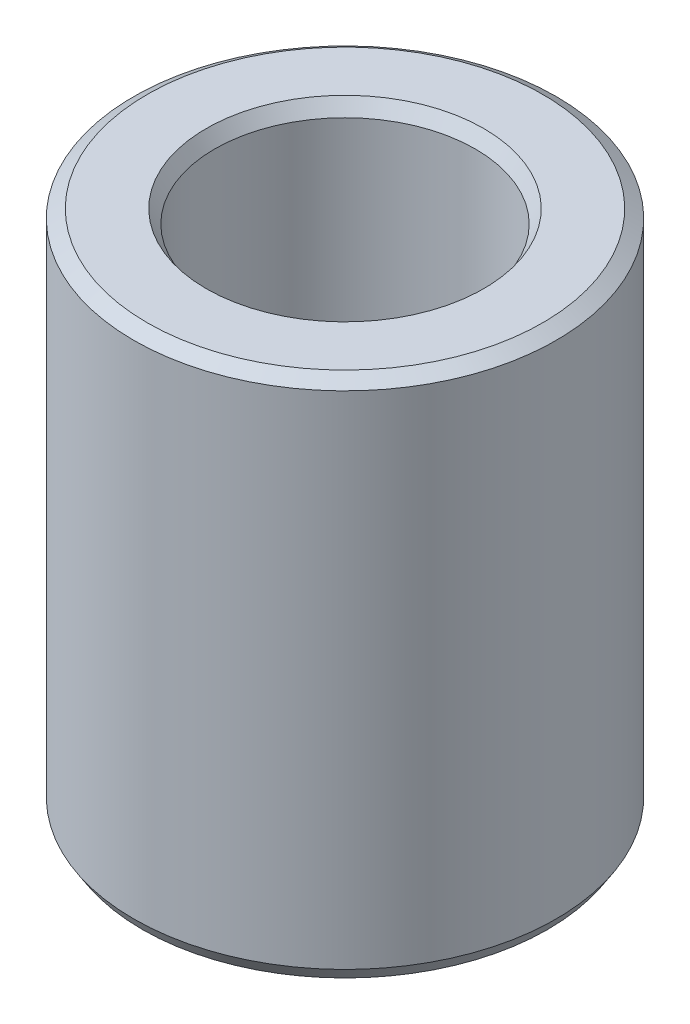
ISO-10303-21;
HEADER;
FILE_DESCRIPTION(('STEP AP214'),'2;1');
FILE_NAME('part.step','',(''),(''),'','','');
FILE_SCHEMA(('AUTOMOTIVE_DESIGN { 1 0 10303 214 1 1 1 1 }'));
ENDSEC;
DATA;
#1=APPLICATION_CONTEXT('core data for automotive mechanical design processes');
#2=APPLICATION_PROTOCOL_DEFINITION('international standard','automotive_design',2000,#1);
#3=PRODUCT_CONTEXT('',#1,'mechanical');
#4=PRODUCT('Part','Part','',(#3));
#5=PRODUCT_RELATED_PRODUCT_CATEGORY('part','',(#4));
#6=PRODUCT_DEFINITION_FORMATION('','',#4);
#7=PRODUCT_DEFINITION_CONTEXT('part definition',#1,'design');
#8=PRODUCT_DEFINITION('design','',#6,#7);
#9=PRODUCT_DEFINITION_SHAPE('','',#8);
#10=(LENGTH_UNIT() NAMED_UNIT(*) SI_UNIT(.MILLI.,.METRE.));
#11=(NAMED_UNIT(*) PLANE_ANGLE_UNIT() SI_UNIT($,.RADIAN.));
#12=(NAMED_UNIT(*) SI_UNIT($,.STERADIAN.) SOLID_ANGLE_UNIT());
#13=UNCERTAINTY_MEASURE_WITH_UNIT(LENGTH_MEASURE(1.E-05),#10,'distance_accuracy_value','');
#14=(GEOMETRIC_REPRESENTATION_CONTEXT(3) GLOBAL_UNCERTAINTY_ASSIGNED_CONTEXT((#13)) GLOBAL_UNIT_ASSIGNED_CONTEXT((#10,
#11,#12)) REPRESENTATION_CONTEXT('',''));
#15=CARTESIAN_POINT('',(0.,0.,0.));
#16=DIRECTION('',(0.,0.,1.));
#17=DIRECTION('',(1.,0.,0.));
#18=AXIS2_PLACEMENT_3D('',#15,#16,#17);
#19=CARTESIAN_POINT('',(0.,80.4752144266924,0.));
#20=DIRECTION('',(0.,-1.,0.));
#21=DIRECTION('',(0.,0.,-1.));
#22=AXIS2_PLACEMENT_3D('',#19,#20,#21);
#23=CYLINDRICAL_SURFACE('',#22,32.5);
#24=CARTESIAN_POINT('',(0.,2.06493356965377,0.));
#25=DIRECTION('',(0.,1.,0.));
#26=DIRECTION('',(0.,0.,1.));
#27=AXIS2_PLACEMENT_3D('',#24,#25,#26);
#28=CIRCLE('',#27,32.5);
#29=CARTESIAN_POINT('',(0.,2.06493356965377,32.5));
#30=VERTEX_POINT('',#29);
#31=EDGE_CURVE('E10',#30,#30,#28,.T.);
#32=ORIENTED_EDGE('',*,*,#31,.T.);
#33=EDGE_LOOP('',(#32));
#34=FACE_BOUND('',#33,.T.);
#35=CARTESIAN_POINT('',(0.,79.163906193543,0.));
#36=DIRECTION('',(0.,1.,0.));
#37=DIRECTION('',(0.,0.,1.));
#38=AXIS2_PLACEMENT_3D('',#35,#36,#37);
#39=CIRCLE('',#38,32.5);
#40=CARTESIAN_POINT('',(0.,79.163906193543,32.5));
#41=VERTEX_POINT('',#40);
#42=EDGE_CURVE('E50',#41,#41,#39,.F.);
#43=ORIENTED_EDGE('',*,*,#42,.T.);
#44=EDGE_LOOP('',(#43));
#45=FACE_BOUND('',#44,.T.);
#46=ADVANCED_FACE('F39',(#34,#45),#23,.T.);
#47=CARTESIAN_POINT('',(0.,80.4752144266924,0.));
#48=DIRECTION('',(0.,1.,0.));
#49=DIRECTION('',(0.,0.,1.));
#50=AXIS2_PLACEMENT_3D('',#47,#48,#49);
#51=PLANE('',#50);
#52=CARTESIAN_POINT('',(0.,80.4752144266924,0.));
#53=DIRECTION('',(0.,1.,0.));
#54=DIRECTION('',(0.,0.,1.));
#55=AXIS2_PLACEMENT_3D('',#52,#53,#54);
#56=CIRCLE('',#55,21.3533552861544);
#57=CARTESIAN_POINT('',(0.,80.4752144266924,21.3533552861544));
#58=VERTEX_POINT('',#57);
#59=EDGE_CURVE('E58',#58,#58,#56,.F.);
#60=ORIENTED_EDGE('',*,*,#59,.T.);
#61=EDGE_LOOP('',(#60));
#62=FACE_BOUND('',#61,.T.);
#63=CARTESIAN_POINT('',(0.,80.4752144266924,0.));
#64=DIRECTION('',(0.,1.,0.));
#65=DIRECTION('',(0.,0.,1.));
#66=AXIS2_PLACEMENT_3D('',#63,#64,#65);
#67=CIRCLE('',#66,30.4350664303462);
#68=CARTESIAN_POINT('',(0.,80.4752144266924,30.4350664303462));
#69=VERTEX_POINT('',#68);
#70=EDGE_CURVE('E61',#69,#69,#67,.T.);
#71=ORIENTED_EDGE('',*,*,#70,.T.);
#72=EDGE_LOOP('',(#71));
#73=FACE_BOUND('',#72,.T.);
#74=ADVANCED_FACE('F88',(#62,#73),#51,.T.);
#75=CARTESIAN_POINT('',(0.,0.,0.));
#76=DIRECTION('',(0.,1.,0.));
#77=DIRECTION('',(0.,0.,1.));
#78=AXIS2_PLACEMENT_3D('',#75,#76,#77);
#79=PLANE('',#78);
#80=CARTESIAN_POINT('',(0.,0.,0.));
#81=DIRECTION('',(0.,1.,0.));
#82=DIRECTION('',(0.,0.,1.));
#83=AXIS2_PLACEMENT_3D('',#80,#81,#82);
#84=CIRCLE('',#83,22.1069806226588);
#85=CARTESIAN_POINT('',(0.,0.,22.1069806226588));
#86=VERTEX_POINT('',#85);
#87=EDGE_CURVE('E51',#86,#86,#84,.T.);
#88=ORIENTED_EDGE('',*,*,#87,.T.);
#89=EDGE_LOOP('',(#88));
#90=FACE_BOUND('',#89,.T.);
#91=CARTESIAN_POINT('',(0.,0.,0.));
#92=DIRECTION('',(0.,1.,0.));
#93=DIRECTION('',(0.,0.,1.));
#94=AXIS2_PLACEMENT_3D('',#91,#92,#93);
#95=CIRCLE('',#94,31.1886917668506);
#96=CARTESIAN_POINT('',(0.,0.,31.1886917668506));
#97=VERTEX_POINT('',#96);
#98=EDGE_CURVE('E54',#97,#97,#95,.F.);
#99=ORIENTED_EDGE('',*,*,#98,.T.);
#100=EDGE_LOOP('',(#99));
#101=FACE_BOUND('',#100,.T.);
#102=ADVANCED_FACE('F83',(#90,#101),#79,.F.);
#103=CARTESIAN_POINT('',(0.,80.4752144266924,0.));
#104=DIRECTION('',(0.,-1.,0.));
#105=DIRECTION('',(0.,0.,-1.));
#106=AXIS2_PLACEMENT_3D('',#103,#104,#105);
#107=CYLINDRICAL_SURFACE('',#106,20.042047053005);
#108=CARTESIAN_POINT('',(0.,78.4102808570387,0.));
#109=DIRECTION('',(0.,1.,0.));
#110=DIRECTION('',(0.,0.,1.));
#111=AXIS2_PLACEMENT_3D('',#108,#109,#110);
#112=CIRCLE('',#111,20.042047053005);
#113=CARTESIAN_POINT('',(0.,78.4102808570387,20.042047053005));
#114=VERTEX_POINT('',#113);
#115=EDGE_CURVE('E67',#114,#114,#112,.T.);
#116=ORIENTED_EDGE('',*,*,#115,.T.);
#117=EDGE_LOOP('',(#116));
#118=FACE_BOUND('',#117,.T.);
#119=CARTESIAN_POINT('',(0.,1.31130823314941,0.));
#120=DIRECTION('',(0.,1.,0.));
#121=DIRECTION('',(0.,0.,1.));
#122=AXIS2_PLACEMENT_3D('',#119,#120,#121);
#123=CIRCLE('',#122,20.042047053005);
#124=CARTESIAN_POINT('',(0.,1.31130823314941,20.042047053005));
#125=VERTEX_POINT('',#124);
#126=EDGE_CURVE('E69',#125,#125,#123,.F.);
#127=ORIENTED_EDGE('',*,*,#126,.T.);
#128=EDGE_LOOP('',(#127));
#129=FACE_BOUND('',#128,.T.);
#130=ADVANCED_FACE('F71',(#118,#129),#107,.F.);
#131=CARTESIAN_POINT('',(0.,78.4102808570387,0.));
#132=DIRECTION('',(0.,1.,0.));
#133=DIRECTION('',(0.,0.,1.));
#134=AXIS2_PLACEMENT_3D('',#131,#132,#133);
#135=CONICAL_SURFACE('',#134,20.042047053005,0.565784056815227);
#136=ORIENTED_EDGE('',*,*,#59,.F.);
#137=EDGE_LOOP('',(#136));
#138=FACE_BOUND('',#137,.T.);
#139=ORIENTED_EDGE('',*,*,#115,.F.);
#140=EDGE_LOOP('',(#139));
#141=FACE_BOUND('',#140,.T.);
#142=ADVANCED_FACE('F77',(#138,#141),#135,.F.);
#143=CARTESIAN_POINT('',(0.,0.,0.));
#144=DIRECTION('',(0.,-1.,0.));
#145=DIRECTION('',(0.,0.,-1.));
#146=AXIS2_PLACEMENT_3D('',#143,#144,#145);
#147=CONICAL_SURFACE('',#146,22.1069806226588,1.00501226997967);
#148=ORIENTED_EDGE('',*,*,#126,.F.);
#149=EDGE_LOOP('',(#148));
#150=FACE_BOUND('',#149,.T.);
#151=ORIENTED_EDGE('',*,*,#87,.F.);
#152=EDGE_LOOP('',(#151));
#153=FACE_BOUND('',#152,.T.);
#154=ADVANCED_FACE('F73',(#150,#153),#147,.F.);
#155=CARTESIAN_POINT('',(0.,2.06493356965377,0.));
#156=DIRECTION('',(0.,1.,0.));
#157=DIRECTION('',(0.,0.,1.));
#158=AXIS2_PLACEMENT_3D('',#155,#156,#157);
#159=CONICAL_SURFACE('',#158,32.5,0.565784056815223);
#160=ORIENTED_EDGE('',*,*,#98,.F.);
#161=EDGE_LOOP('',(#160));
#162=FACE_BOUND('',#161,.T.);
#163=ORIENTED_EDGE('',*,*,#31,.F.);
#164=EDGE_LOOP('',(#163));
#165=FACE_BOUND('',#164,.T.);
#166=ADVANCED_FACE('F76',(#162,#165),#159,.T.);
#167=CARTESIAN_POINT('',(0.,80.4752144266924,0.));
#168=DIRECTION('',(0.,-1.,0.));
#169=DIRECTION('',(0.,0.,-1.));
#170=AXIS2_PLACEMENT_3D('',#167,#168,#169);
#171=CONICAL_SURFACE('',#170,30.4350664303462,1.00501226997967);
#172=ORIENTED_EDGE('',*,*,#42,.F.);
#173=EDGE_LOOP('',(#172));
#174=FACE_BOUND('',#173,.T.);
#175=ORIENTED_EDGE('',*,*,#70,.F.);
#176=EDGE_LOOP('',(#175));
#177=FACE_BOUND('',#176,.T.);
#178=ADVANCED_FACE('F45',(#174,#177),#171,.T.);
#179=CLOSED_SHELL('',(#46,#74,#102,#130,#142,#154,#166,#178));
#180=MANIFOLD_SOLID_BREP('B2',#179);
#181=ADVANCED_BREP_SHAPE_REPRESENTATION('',(#18,#180),#14);
#182=SHAPE_DEFINITION_REPRESENTATION(#9,#181);
ENDSEC;
END-ISO-10303-21;
